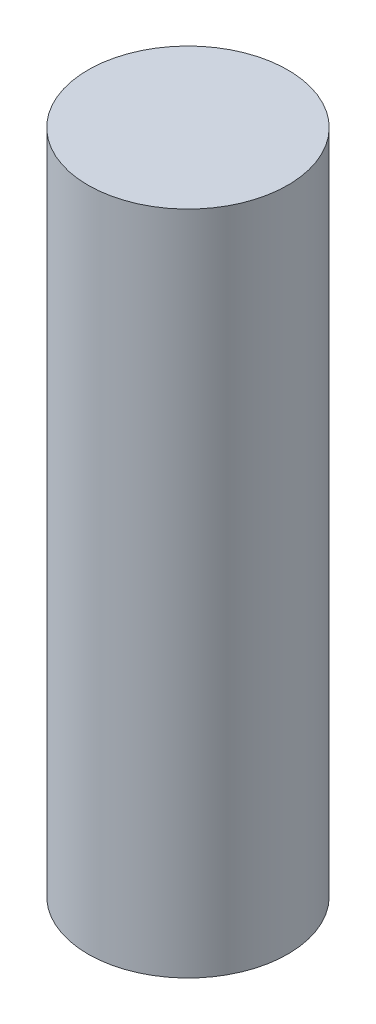
ISO-10303-21;
HEADER;
FILE_DESCRIPTION(('STEP AP214'),'2;1');
FILE_NAME('part.step','',(''),(''),'','','');
FILE_SCHEMA(('AUTOMOTIVE_DESIGN { 1 0 10303 214 1 1 1 1 }'));
ENDSEC;
DATA;
#1=APPLICATION_CONTEXT('core data for automotive mechanical design processes');
#2=APPLICATION_PROTOCOL_DEFINITION('international standard','automotive_design',2000,#1);
#3=PRODUCT_CONTEXT('',#1,'mechanical');
#4=PRODUCT('Part','Part','',(#3));
#5=PRODUCT_RELATED_PRODUCT_CATEGORY('part','',(#4));
#6=PRODUCT_DEFINITION_FORMATION('','',#4);
#7=PRODUCT_DEFINITION_CONTEXT('part definition',#1,'design');
#8=PRODUCT_DEFINITION('design','',#6,#7);
#9=PRODUCT_DEFINITION_SHAPE('','',#8);
#10=(LENGTH_UNIT() NAMED_UNIT(*) SI_UNIT(.MILLI.,.METRE.));
#11=(NAMED_UNIT(*) PLANE_ANGLE_UNIT() SI_UNIT($,.RADIAN.));
#12=(NAMED_UNIT(*) SI_UNIT($,.STERADIAN.) SOLID_ANGLE_UNIT());
#13=UNCERTAINTY_MEASURE_WITH_UNIT(LENGTH_MEASURE(1.E-05),#10,'distance_accuracy_value','');
#14=(GEOMETRIC_REPRESENTATION_CONTEXT(3) GLOBAL_UNCERTAINTY_ASSIGNED_CONTEXT((#13)) GLOBAL_UNIT_ASSIGNED_CONTEXT((#10,
#11,#12)) REPRESENTATION_CONTEXT('',''));
#15=CARTESIAN_POINT('',(0.,0.,0.));
#16=DIRECTION('',(0.,0.,1.));
#17=DIRECTION('',(1.,0.,0.));
#18=AXIS2_PLACEMENT_3D('',#15,#16,#17);
#19=CARTESIAN_POINT('',(0.,63.5,0.));
#20=DIRECTION('',(0.,-1.,0.));
#21=DIRECTION('',(0.,0.,-1.));
#22=AXIS2_PLACEMENT_3D('',#19,#20,#21);
#23=CYLINDRICAL_SURFACE('',#22,9.525);
#24=CARTESIAN_POINT('',(0.,63.5,0.));
#25=DIRECTION('',(0.,1.,0.));
#26=DIRECTION('',(0.,0.,1.));
#27=AXIS2_PLACEMENT_3D('',#24,#25,#26);
#28=CIRCLE('',#27,9.525);
#29=CARTESIAN_POINT('',(0.,63.5,9.525));
#30=VERTEX_POINT('',#29);
#31=EDGE_CURVE('E10',#30,#30,#28,.T.);
#32=ORIENTED_EDGE('',*,*,#31,.F.);
#33=EDGE_LOOP('',(#32));
#34=FACE_BOUND('',#33,.T.);
#35=CARTESIAN_POINT('',(0.,0.,0.));
#36=DIRECTION('',(0.,1.,0.));
#37=DIRECTION('',(0.,0.,1.));
#38=AXIS2_PLACEMENT_3D('',#35,#36,#37);
#39=CIRCLE('',#38,9.525);
#40=CARTESIAN_POINT('',(0.,0.,9.525));
#41=VERTEX_POINT('',#40);
#42=EDGE_CURVE('E37',#41,#41,#39,.T.);
#43=ORIENTED_EDGE('',*,*,#42,.T.);
#44=EDGE_LOOP('',(#43));
#45=FACE_BOUND('',#44,.T.);
#46=ADVANCED_FACE('F34',(#34,#45),#23,.T.);
#47=CARTESIAN_POINT('',(0.,63.5,0.));
#48=DIRECTION('',(0.,1.,0.));
#49=DIRECTION('',(0.,0.,1.));
#50=AXIS2_PLACEMENT_3D('',#47,#48,#49);
#51=PLANE('',#50);
#52=ORIENTED_EDGE('',*,*,#31,.T.);
#53=EDGE_LOOP('',(#52));
#54=FACE_BOUND('',#53,.T.);
#55=ADVANCED_FACE('F49',(#54),#51,.T.);
#56=CARTESIAN_POINT('',(0.,0.,0.));
#57=DIRECTION('',(0.,1.,0.));
#58=DIRECTION('',(0.,0.,1.));
#59=AXIS2_PLACEMENT_3D('',#56,#57,#58);
#60=PLANE('',#59);
#61=ORIENTED_EDGE('',*,*,#42,.F.);
#62=EDGE_LOOP('',(#61));
#63=FACE_BOUND('',#62,.T.);
#64=ADVANCED_FACE('F47',(#63),#60,.F.);
#65=CLOSED_SHELL('',(#46,#55,#64));
#66=MANIFOLD_SOLID_BREP('B2',#65);
#67=ADVANCED_BREP_SHAPE_REPRESENTATION('',(#18,#66),#14);
#68=SHAPE_DEFINITION_REPRESENTATION(#9,#67);
ENDSEC;
END-ISO-10303-21;
